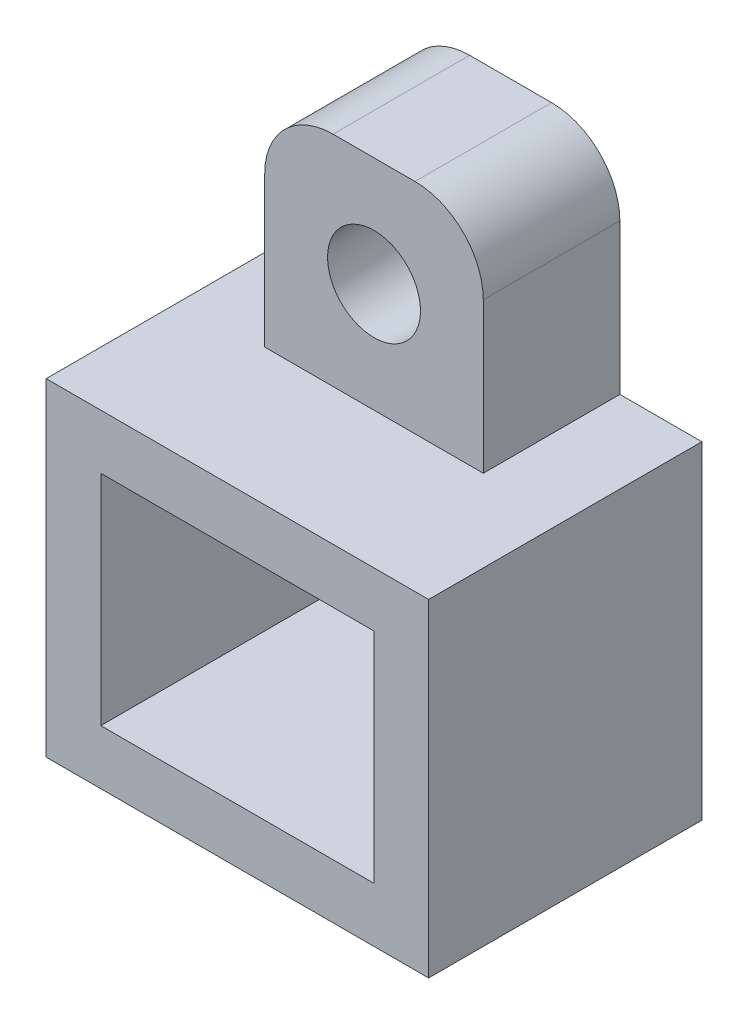
ISO-10303-21;
HEADER;
FILE_DESCRIPTION(('STEP AP214'),'2;1');
FILE_NAME('part.step','',(''),(''),'','','');
FILE_SCHEMA(('AUTOMOTIVE_DESIGN { 1 0 10303 214 1 1 1 1 }'));
ENDSEC;
DATA;
#1=APPLICATION_CONTEXT('core data for automotive mechanical design processes');
#2=APPLICATION_PROTOCOL_DEFINITION('international standard','automotive_design',2000,#1);
#3=PRODUCT_CONTEXT('',#1,'mechanical');
#4=PRODUCT('Part','Part','',(#3));
#5=PRODUCT_RELATED_PRODUCT_CATEGORY('part','',(#4));
#6=PRODUCT_DEFINITION_FORMATION('','',#4);
#7=PRODUCT_DEFINITION_CONTEXT('part definition',#1,'design');
#8=PRODUCT_DEFINITION('design','',#6,#7);
#9=PRODUCT_DEFINITION_SHAPE('','',#8);
#10=(LENGTH_UNIT() NAMED_UNIT(*) SI_UNIT(.MILLI.,.METRE.));
#11=(NAMED_UNIT(*) PLANE_ANGLE_UNIT() SI_UNIT($,.RADIAN.));
#12=(NAMED_UNIT(*) SI_UNIT($,.STERADIAN.) SOLID_ANGLE_UNIT());
#13=UNCERTAINTY_MEASURE_WITH_UNIT(LENGTH_MEASURE(1.E-05),#10,'distance_accuracy_value','');
#14=(GEOMETRIC_REPRESENTATION_CONTEXT(3) GLOBAL_UNCERTAINTY_ASSIGNED_CONTEXT((#13)) GLOBAL_UNIT_ASSIGNED_CONTEXT((#10,
#11,#12)) REPRESENTATION_CONTEXT('',''));
#15=CARTESIAN_POINT('',(0.,0.,0.));
#16=DIRECTION('',(0.,0.,1.));
#17=DIRECTION('',(1.,0.,0.));
#18=AXIS2_PLACEMENT_3D('',#15,#16,#17);
#19=CARTESIAN_POINT('',(0.,0.,0.));
#20=DIRECTION('',(0.,0.,1.));
#21=DIRECTION('',(1.,0.,0.));
#22=AXIS2_PLACEMENT_3D('',#19,#20,#21);
#23=PLANE('',#22);
#24=DIRECTION('',(0.,1.,0.));
#25=VECTOR('',#24,1.);
#26=CARTESIAN_POINT('',(5.00000000000001,4.00000000000001,0.));
#27=LINE('',#26,#25);
#28=CARTESIAN_POINT('',(5.,-3.99999999999999,0.));
#29=VERTEX_POINT('',#28);
#30=CARTESIAN_POINT('',(5.00000000000001,4.00000000000001,0.));
#31=VERTEX_POINT('',#30);
#32=EDGE_CURVE('E151',#29,#31,#27,.T.);
#33=ORIENTED_EDGE('',*,*,#32,.T.);
#34=DIRECTION('',(-1.,0.,0.));
#35=VECTOR('',#34,1.);
#36=CARTESIAN_POINT('',(-5.,4.00000000000001,0.));
#37=LINE('',#36,#35);
#38=CARTESIAN_POINT('',(-5.,4.00000000000001,0.));
#39=VERTEX_POINT('',#38);
#40=EDGE_CURVE('E391',#31,#39,#37,.T.);
#41=ORIENTED_EDGE('',*,*,#40,.T.);
#42=DIRECTION('',(0.,-1.,0.));
#43=VECTOR('',#42,1.);
#44=CARTESIAN_POINT('',(-5.,4.00000000000001,0.));
#45=LINE('',#44,#43);
#46=CARTESIAN_POINT('',(-5.,-3.99999999999999,0.));
#47=VERTEX_POINT('',#46);
#48=EDGE_CURVE('E394',#39,#47,#45,.T.);
#49=ORIENTED_EDGE('',*,*,#48,.T.);
#50=DIRECTION('',(1.,0.,0.));
#51=VECTOR('',#50,1.);
#52=CARTESIAN_POINT('',(-5.,-3.99999999999999,0.));
#53=LINE('',#52,#51);
#54=EDGE_CURVE('E386',#47,#29,#53,.T.);
#55=ORIENTED_EDGE('',*,*,#54,.T.);
#56=EDGE_LOOP('',(#33,#41,#49,#55));
#57=FACE_BOUND('',#56,.T.);
#58=DIRECTION('',(-1.,0.,0.));
#59=VECTOR('',#58,1.);
#60=CARTESIAN_POINT('',(-4.,14.,0.));
#61=LINE('',#60,#59);
#62=CARTESIAN_POINT('',(1.5,14.,0.));
#63=VERTEX_POINT('',#62);
#64=CARTESIAN_POINT('',(-1.5,14.,0.));
#65=VERTEX_POINT('',#64);
#66=EDGE_CURVE('E142',#63,#65,#61,.T.);
#67=ORIENTED_EDGE('',*,*,#66,.F.);
#68=CARTESIAN_POINT('',(1.5,11.5,0.));
#69=DIRECTION('',(0.,0.,1.));
#70=DIRECTION('',(1.,0.,0.));
#71=AXIS2_PLACEMENT_3D('',#68,#69,#70);
#72=CIRCLE('',#71,2.5);
#73=CARTESIAN_POINT('',(4.,11.5,0.));
#74=VERTEX_POINT('',#73);
#75=EDGE_CURVE('E194',#63,#74,#72,.F.);
#76=ORIENTED_EDGE('',*,*,#75,.T.);
#77=DIRECTION('',(0.,1.,0.));
#78=VECTOR('',#77,1.);
#79=CARTESIAN_POINT('',(4.,6.00000000000001,0.));
#80=LINE('',#79,#78);
#81=CARTESIAN_POINT('',(4.,6.00000000000001,0.));
#82=VERTEX_POINT('',#81);
#83=EDGE_CURVE('E166',#82,#74,#80,.T.);
#84=ORIENTED_EDGE('',*,*,#83,.F.);
#85=DIRECTION('',(-1.,0.,0.));
#86=VECTOR('',#85,1.);
#87=CARTESIAN_POINT('',(-7.00000000000001,6.00000000000001,0.));
#88=LINE('',#87,#86);
#89=CARTESIAN_POINT('',(7.00000000000001,6.00000000000001,0.));
#90=VERTEX_POINT('',#89);
#91=EDGE_CURVE('E427',#90,#82,#88,.T.);
#92=ORIENTED_EDGE('',*,*,#91,.F.);
#93=DIRECTION('',(0.,1.,0.));
#94=VECTOR('',#93,1.);
#95=CARTESIAN_POINT('',(7.00000000000001,6.00000000000001,0.));
#96=LINE('',#95,#94);
#97=CARTESIAN_POINT('',(7.00000000000001,-6.00000000000001,0.));
#98=VERTEX_POINT('',#97);
#99=EDGE_CURVE('E408',#98,#90,#96,.T.);
#100=ORIENTED_EDGE('',*,*,#99,.F.);
#101=DIRECTION('',(1.,0.,0.));
#102=VECTOR('',#101,1.);
#103=CARTESIAN_POINT('',(-7.00000000000001,-6.00000000000001,0.));
#104=LINE('',#103,#102);
#105=CARTESIAN_POINT('',(-7.00000000000001,-6.00000000000001,0.));
#106=VERTEX_POINT('',#105);
#107=EDGE_CURVE('E411',#106,#98,#104,.T.);
#108=ORIENTED_EDGE('',*,*,#107,.F.);
#109=DIRECTION('',(0.,-1.,0.));
#110=VECTOR('',#109,1.);
#111=CARTESIAN_POINT('',(-7.00000000000001,6.00000000000001,0.));
#112=LINE('',#111,#110);
#113=CARTESIAN_POINT('',(-7.00000000000001,6.00000000000001,0.));
#114=VERTEX_POINT('',#113);
#115=EDGE_CURVE('E423',#114,#106,#112,.T.);
#116=ORIENTED_EDGE('',*,*,#115,.F.);
#117=CARTESIAN_POINT('',(-4.,6.00000000000001,0.));
#118=VERTEX_POINT('',#117);
#119=EDGE_CURVE('E420',#118,#114,#88,.T.);
#120=ORIENTED_EDGE('',*,*,#119,.F.);
#121=DIRECTION('',(0.,-1.,0.));
#122=VECTOR('',#121,1.);
#123=CARTESIAN_POINT('',(-4.,6.00000000000001,0.));
#124=LINE('',#123,#122);
#125=CARTESIAN_POINT('',(-4.,11.5,0.));
#126=VERTEX_POINT('',#125);
#127=EDGE_CURVE('E148',#126,#118,#124,.T.);
#128=ORIENTED_EDGE('',*,*,#127,.F.);
#129=CARTESIAN_POINT('',(-1.5,11.5,0.));
#130=DIRECTION('',(0.,0.,1.));
#131=DIRECTION('',(1.,0.,0.));
#132=AXIS2_PLACEMENT_3D('',#129,#130,#131);
#133=CIRCLE('',#132,2.5);
#134=EDGE_CURVE('E191',#126,#65,#133,.F.);
#135=ORIENTED_EDGE('',*,*,#134,.T.);
#136=EDGE_LOOP('',(#67,#76,#84,#92,#100,#108,#116,#120,#128,#135));
#137=FACE_BOUND('',#136,.T.);
#138=CARTESIAN_POINT('',(0.,10.,0.));
#139=DIRECTION('',(0.,0.,1.));
#140=DIRECTION('',(1.,0.,0.));
#141=AXIS2_PLACEMENT_3D('',#138,#139,#140);
#142=CIRCLE('',#141,1.7);
#143=CARTESIAN_POINT('',(1.7,10.,0.));
#144=VERTEX_POINT('',#143);
#145=EDGE_CURVE('E184',#144,#144,#142,.T.);
#146=ORIENTED_EDGE('',*,*,#145,.T.);
#147=EDGE_LOOP('',(#146));
#148=FACE_BOUND('',#147,.T.);
#149=ADVANCED_FACE('F33',(#57,#137,#148),#23,.F.);
#150=CARTESIAN_POINT('',(0.,0.,5.));
#151=DIRECTION('',(0.,0.,-1.));
#152=DIRECTION('',(-1.,0.,0.));
#153=AXIS2_PLACEMENT_3D('',#150,#151,#152);
#154=PLANE('',#153);
#155=DIRECTION('',(0.,1.,0.));
#156=VECTOR('',#155,1.);
#157=CARTESIAN_POINT('',(4.,6.00000000000001,5.));
#158=LINE('',#157,#156);
#159=CARTESIAN_POINT('',(4.,6.00000000000001,5.));
#160=VERTEX_POINT('',#159);
#161=CARTESIAN_POINT('',(4.,11.5,5.));
#162=VERTEX_POINT('',#161);
#163=EDGE_CURVE('E157',#160,#162,#158,.T.);
#164=ORIENTED_EDGE('',*,*,#163,.T.);
#165=CARTESIAN_POINT('',(1.5,11.5,5.));
#166=DIRECTION('',(0.,0.,-1.));
#167=DIRECTION('',(-1.,0.,0.));
#168=AXIS2_PLACEMENT_3D('',#165,#166,#167);
#169=CIRCLE('',#168,2.5);
#170=CARTESIAN_POINT('',(1.5,14.,5.));
#171=VERTEX_POINT('',#170);
#172=EDGE_CURVE('E41',#162,#171,#169,.F.);
#173=ORIENTED_EDGE('',*,*,#172,.T.);
#174=DIRECTION('',(-1.,0.,0.));
#175=VECTOR('',#174,1.);
#176=CARTESIAN_POINT('',(-4.,14.,5.));
#177=LINE('',#176,#175);
#178=CARTESIAN_POINT('',(-1.5,14.,5.));
#179=VERTEX_POINT('',#178);
#180=EDGE_CURVE('E159',#171,#179,#177,.T.);
#181=ORIENTED_EDGE('',*,*,#180,.T.);
#182=CARTESIAN_POINT('',(-1.5,11.5,5.));
#183=DIRECTION('',(0.,0.,-1.));
#184=DIRECTION('',(-1.,0.,0.));
#185=AXIS2_PLACEMENT_3D('',#182,#183,#184);
#186=CIRCLE('',#185,2.5);
#187=CARTESIAN_POINT('',(-4.,11.5,5.));
#188=VERTEX_POINT('',#187);
#189=EDGE_CURVE('E48',#179,#188,#186,.F.);
#190=ORIENTED_EDGE('',*,*,#189,.T.);
#191=DIRECTION('',(0.,-1.,0.));
#192=VECTOR('',#191,1.);
#193=CARTESIAN_POINT('',(-4.,6.00000000000001,5.));
#194=LINE('',#193,#192);
#195=CARTESIAN_POINT('',(-4.,6.00000000000001,5.));
#196=VERTEX_POINT('',#195);
#197=EDGE_CURVE('E134',#188,#196,#194,.T.);
#198=ORIENTED_EDGE('',*,*,#197,.T.);
#199=DIRECTION('',(1.,0.,0.));
#200=VECTOR('',#199,1.);
#201=CARTESIAN_POINT('',(-4.,6.00000000000001,5.));
#202=LINE('',#201,#200);
#203=EDGE_CURVE('E139',#196,#160,#202,.T.);
#204=ORIENTED_EDGE('',*,*,#203,.T.);
#205=EDGE_LOOP('',(#164,#173,#181,#190,#198,#204));
#206=FACE_BOUND('',#205,.T.);
#207=CARTESIAN_POINT('',(0.,10.,5.));
#208=DIRECTION('',(0.,0.,-1.));
#209=DIRECTION('',(-1.,0.,0.));
#210=AXIS2_PLACEMENT_3D('',#207,#208,#209);
#211=CIRCLE('',#210,1.7);
#212=CARTESIAN_POINT('',(-1.7,10.,5.));
#213=VERTEX_POINT('',#212);
#214=EDGE_CURVE('E181',#213,#213,#211,.F.);
#215=ORIENTED_EDGE('',*,*,#214,.F.);
#216=EDGE_LOOP('',(#215));
#217=FACE_BOUND('',#216,.T.);
#218=ADVANCED_FACE('F136',(#206,#217),#154,.F.);
#219=CARTESIAN_POINT('',(-7.00000000000001,6.00000000000001,10.));
#220=DIRECTION('',(0.,-1.,0.));
#221=DIRECTION('',(0.,0.,-1.));
#222=AXIS2_PLACEMENT_3D('',#219,#220,#221);
#223=PLANE('',#222);
#224=DIRECTION('',(0.,0.,-1.));
#225=VECTOR('',#224,1.);
#226=CARTESIAN_POINT('',(4.,6.00000000000001,5.));
#227=LINE('',#226,#225);
#228=EDGE_CURVE('E152',#160,#82,#227,.T.);
#229=ORIENTED_EDGE('',*,*,#228,.F.);
#230=ORIENTED_EDGE('',*,*,#203,.F.);
#231=DIRECTION('',(0.,0.,-1.));
#232=VECTOR('',#231,1.);
#233=CARTESIAN_POINT('',(-4.,6.00000000000001,5.));
#234=LINE('',#233,#232);
#235=EDGE_CURVE('E145',#196,#118,#234,.T.);
#236=ORIENTED_EDGE('',*,*,#235,.T.);
#237=ORIENTED_EDGE('',*,*,#119,.T.);
#238=DIRECTION('',(0.,0.,-1.));
#239=VECTOR('',#238,1.);
#240=CARTESIAN_POINT('',(-7.00000000000001,6.00000000000001,10.));
#241=LINE('',#240,#239);
#242=CARTESIAN_POINT('',(-7.00000000000001,6.00000000000001,10.));
#243=VERTEX_POINT('',#242);
#244=EDGE_CURVE('E431',#243,#114,#241,.T.);
#245=ORIENTED_EDGE('',*,*,#244,.F.);
#246=DIRECTION('',(-1.,0.,0.));
#247=VECTOR('',#246,1.);
#248=CARTESIAN_POINT('',(-7.00000000000001,6.00000000000001,10.));
#249=LINE('',#248,#247);
#250=CARTESIAN_POINT('',(7.00000000000001,6.00000000000001,10.));
#251=VERTEX_POINT('',#250);
#252=EDGE_CURVE('E410',#251,#243,#249,.T.);
#253=ORIENTED_EDGE('',*,*,#252,.F.);
#254=DIRECTION('',(0.,0.,-1.));
#255=VECTOR('',#254,1.);
#256=CARTESIAN_POINT('',(7.00000000000001,6.00000000000001,10.));
#257=LINE('',#256,#255);
#258=EDGE_CURVE('E188',#251,#90,#257,.T.);
#259=ORIENTED_EDGE('',*,*,#258,.T.);
#260=ORIENTED_EDGE('',*,*,#91,.T.);
#261=EDGE_LOOP('',(#229,#230,#236,#237,#245,#253,#259,#260));
#262=FACE_BOUND('',#261,.T.);
#263=ADVANCED_FACE('F155',(#262),#223,.F.);
#264=CARTESIAN_POINT('',(0.,0.,10.));
#265=DIRECTION('',(0.,0.,1.));
#266=DIRECTION('',(1.,0.,0.));
#267=AXIS2_PLACEMENT_3D('',#264,#265,#266);
#268=PLANE('',#267);
#269=DIRECTION('',(0.,1.,0.));
#270=VECTOR('',#269,1.);
#271=CARTESIAN_POINT('',(7.00000000000001,6.00000000000001,10.));
#272=LINE('',#271,#270);
#273=CARTESIAN_POINT('',(7.00000000000001,-6.00000000000001,10.));
#274=VERTEX_POINT('',#273);
#275=EDGE_CURVE('E373',#274,#251,#272,.T.);
#276=ORIENTED_EDGE('',*,*,#275,.T.);
#277=ORIENTED_EDGE('',*,*,#252,.T.);
#278=DIRECTION('',(0.,-1.,0.));
#279=VECTOR('',#278,1.);
#280=CARTESIAN_POINT('',(-7.00000000000001,6.00000000000001,10.));
#281=LINE('',#280,#279);
#282=CARTESIAN_POINT('',(-7.00000000000001,-6.00000000000001,10.));
#283=VERTEX_POINT('',#282);
#284=EDGE_CURVE('E413',#243,#283,#281,.T.);
#285=ORIENTED_EDGE('',*,*,#284,.T.);
#286=DIRECTION('',(1.,0.,0.));
#287=VECTOR('',#286,1.);
#288=CARTESIAN_POINT('',(-7.00000000000001,-6.00000000000001,10.));
#289=LINE('',#288,#287);
#290=EDGE_CURVE('E415',#283,#274,#289,.T.);
#291=ORIENTED_EDGE('',*,*,#290,.T.);
#292=EDGE_LOOP('',(#276,#277,#285,#291));
#293=FACE_BOUND('',#292,.T.);
#294=DIRECTION('',(-1.,0.,0.));
#295=VECTOR('',#294,1.);
#296=CARTESIAN_POINT('',(-5.,4.00000000000001,10.));
#297=LINE('',#296,#295);
#298=CARTESIAN_POINT('',(5.00000000000001,4.00000000000001,10.));
#299=VERTEX_POINT('',#298);
#300=CARTESIAN_POINT('',(-5.,4.00000000000001,10.));
#301=VERTEX_POINT('',#300);
#302=EDGE_CURVE('E378',#299,#301,#297,.T.);
#303=ORIENTED_EDGE('',*,*,#302,.F.);
#304=DIRECTION('',(0.,1.,0.));
#305=VECTOR('',#304,1.);
#306=CARTESIAN_POINT('',(5.00000000000001,4.00000000000001,10.));
#307=LINE('',#306,#305);
#308=CARTESIAN_POINT('',(5.,-3.99999999999999,10.));
#309=VERTEX_POINT('',#308);
#310=EDGE_CURVE('E169',#309,#299,#307,.T.);
#311=ORIENTED_EDGE('',*,*,#310,.F.);
#312=DIRECTION('',(1.,0.,0.));
#313=VECTOR('',#312,1.);
#314=CARTESIAN_POINT('',(-5.,-3.99999999999999,10.));
#315=LINE('',#314,#313);
#316=CARTESIAN_POINT('',(-5.,-3.99999999999999,10.));
#317=VERTEX_POINT('',#316);
#318=EDGE_CURVE('E384',#317,#309,#315,.T.);
#319=ORIENTED_EDGE('',*,*,#318,.F.);
#320=DIRECTION('',(0.,-1.,0.));
#321=VECTOR('',#320,1.);
#322=CARTESIAN_POINT('',(-5.,4.00000000000001,10.));
#323=LINE('',#322,#321);
#324=EDGE_CURVE('E381',#301,#317,#323,.T.);
#325=ORIENTED_EDGE('',*,*,#324,.F.);
#326=EDGE_LOOP('',(#303,#311,#319,#325));
#327=FACE_BOUND('',#326,.T.);
#328=ADVANCED_FACE('F230',(#293,#327),#268,.T.);
#329=CARTESIAN_POINT('',(7.00000000000001,6.00000000000001,10.));
#330=DIRECTION('',(-1.,0.,0.));
#331=DIRECTION('',(0.,0.,1.));
#332=AXIS2_PLACEMENT_3D('',#329,#330,#331);
#333=PLANE('',#332);
#334=ORIENTED_EDGE('',*,*,#99,.T.);
#335=ORIENTED_EDGE('',*,*,#258,.F.);
#336=ORIENTED_EDGE('',*,*,#275,.F.);
#337=DIRECTION('',(0.,0.,-1.));
#338=VECTOR('',#337,1.);
#339=CARTESIAN_POINT('',(7.00000000000001,-6.00000000000001,10.));
#340=LINE('',#339,#338);
#341=EDGE_CURVE('E417',#274,#98,#340,.T.);
#342=ORIENTED_EDGE('',*,*,#341,.T.);
#343=EDGE_LOOP('',(#334,#335,#336,#342));
#344=FACE_BOUND('',#343,.T.);
#345=ADVANCED_FACE('F240',(#344),#333,.F.);
#346=CARTESIAN_POINT('',(-7.00000000000001,6.00000000000001,10.));
#347=DIRECTION('',(1.,0.,0.));
#348=DIRECTION('',(0.,0.,-1.));
#349=AXIS2_PLACEMENT_3D('',#346,#347,#348);
#350=PLANE('',#349);
#351=ORIENTED_EDGE('',*,*,#115,.T.);
#352=DIRECTION('',(0.,0.,-1.));
#353=VECTOR('',#352,1.);
#354=CARTESIAN_POINT('',(-7.00000000000001,-6.00000000000001,10.));
#355=LINE('',#354,#353);
#356=EDGE_CURVE('E434',#283,#106,#355,.T.);
#357=ORIENTED_EDGE('',*,*,#356,.F.);
#358=ORIENTED_EDGE('',*,*,#284,.F.);
#359=ORIENTED_EDGE('',*,*,#244,.T.);
#360=EDGE_LOOP('',(#351,#357,#358,#359));
#361=FACE_BOUND('',#360,.T.);
#362=ADVANCED_FACE('F236',(#361),#350,.F.);
#363=CARTESIAN_POINT('',(-7.00000000000001,-6.00000000000001,10.));
#364=DIRECTION('',(0.,1.,0.));
#365=DIRECTION('',(0.,0.,1.));
#366=AXIS2_PLACEMENT_3D('',#363,#364,#365);
#367=PLANE('',#366);
#368=ORIENTED_EDGE('',*,*,#107,.T.);
#369=ORIENTED_EDGE('',*,*,#341,.F.);
#370=ORIENTED_EDGE('',*,*,#290,.F.);
#371=ORIENTED_EDGE('',*,*,#356,.T.);
#372=EDGE_LOOP('',(#368,#369,#370,#371));
#373=FACE_BOUND('',#372,.T.);
#374=ADVANCED_FACE('F232',(#373),#367,.F.);
#375=CARTESIAN_POINT('',(5.00000000000001,4.00000000000001,10.));
#376=DIRECTION('',(-1.,0.,0.));
#377=DIRECTION('',(0.,-1.,0.));
#378=AXIS2_PLACEMENT_3D('',#375,#376,#377);
#379=PLANE('',#378);
#380=ORIENTED_EDGE('',*,*,#32,.F.);
#381=DIRECTION('',(0.,0.,-1.));
#382=VECTOR('',#381,1.);
#383=CARTESIAN_POINT('',(5.,-3.99999999999999,10.));
#384=LINE('',#383,#382);
#385=EDGE_CURVE('E389',#309,#29,#384,.T.);
#386=ORIENTED_EDGE('',*,*,#385,.F.);
#387=ORIENTED_EDGE('',*,*,#310,.T.);
#388=DIRECTION('',(0.,0.,-1.));
#389=VECTOR('',#388,1.);
#390=CARTESIAN_POINT('',(5.00000000000001,4.00000000000001,10.));
#391=LINE('',#390,#389);
#392=EDGE_CURVE('E405',#299,#31,#391,.T.);
#393=ORIENTED_EDGE('',*,*,#392,.T.);
#394=EDGE_LOOP('',(#380,#386,#387,#393));
#395=FACE_BOUND('',#394,.T.);
#396=ADVANCED_FACE('F235',(#395),#379,.T.);
#397=CARTESIAN_POINT('',(-5.,4.00000000000001,10.));
#398=DIRECTION('',(0.,-1.,0.));
#399=DIRECTION('',(0.,0.,-1.));
#400=AXIS2_PLACEMENT_3D('',#397,#398,#399);
#401=PLANE('',#400);
#402=ORIENTED_EDGE('',*,*,#40,.F.);
#403=ORIENTED_EDGE('',*,*,#392,.F.);
#404=ORIENTED_EDGE('',*,*,#302,.T.);
#405=DIRECTION('',(0.,0.,-1.));
#406=VECTOR('',#405,1.);
#407=CARTESIAN_POINT('',(-5.,4.00000000000001,10.));
#408=LINE('',#407,#406);
#409=EDGE_CURVE('E403',#301,#39,#408,.T.);
#410=ORIENTED_EDGE('',*,*,#409,.T.);
#411=EDGE_LOOP('',(#402,#403,#404,#410));
#412=FACE_BOUND('',#411,.T.);
#413=ADVANCED_FACE('F315',(#412),#401,.T.);
#414=CARTESIAN_POINT('',(-5.,4.00000000000001,10.));
#415=DIRECTION('',(1.,0.,0.));
#416=DIRECTION('',(0.,1.,0.));
#417=AXIS2_PLACEMENT_3D('',#414,#415,#416);
#418=PLANE('',#417);
#419=ORIENTED_EDGE('',*,*,#48,.F.);
#420=ORIENTED_EDGE('',*,*,#409,.F.);
#421=ORIENTED_EDGE('',*,*,#324,.T.);
#422=DIRECTION('',(0.,0.,-1.));
#423=VECTOR('',#422,1.);
#424=CARTESIAN_POINT('',(-5.,-3.99999999999999,10.));
#425=LINE('',#424,#423);
#426=EDGE_CURVE('E401',#317,#47,#425,.T.);
#427=ORIENTED_EDGE('',*,*,#426,.T.);
#428=EDGE_LOOP('',(#419,#420,#421,#427));
#429=FACE_BOUND('',#428,.T.);
#430=ADVANCED_FACE('F307',(#429),#418,.T.);
#431=CARTESIAN_POINT('',(-5.,-3.99999999999999,10.));
#432=DIRECTION('',(0.,1.,0.));
#433=DIRECTION('',(0.,0.,1.));
#434=AXIS2_PLACEMENT_3D('',#431,#432,#433);
#435=PLANE('',#434);
#436=ORIENTED_EDGE('',*,*,#54,.F.);
#437=ORIENTED_EDGE('',*,*,#426,.F.);
#438=ORIENTED_EDGE('',*,*,#318,.T.);
#439=ORIENTED_EDGE('',*,*,#385,.T.);
#440=EDGE_LOOP('',(#436,#437,#438,#439));
#441=FACE_BOUND('',#440,.T.);
#442=ADVANCED_FACE('F218',(#441),#435,.T.);
#443=CARTESIAN_POINT('',(-4.,6.00000000000001,5.));
#444=DIRECTION('',(1.,0.,0.));
#445=DIRECTION('',(0.,0.,-1.));
#446=AXIS2_PLACEMENT_3D('',#443,#444,#445);
#447=PLANE('',#446);
#448=ORIENTED_EDGE('',*,*,#197,.F.);
#449=DIRECTION('',(0.,0.,-1.));
#450=VECTOR('',#449,1.);
#451=CARTESIAN_POINT('',(-4.,11.5,5.));
#452=LINE('',#451,#450);
#453=EDGE_CURVE('E11',#188,#126,#452,.T.);
#454=ORIENTED_EDGE('',*,*,#453,.T.);
#455=ORIENTED_EDGE('',*,*,#127,.T.);
#456=ORIENTED_EDGE('',*,*,#235,.F.);
#457=EDGE_LOOP('',(#448,#454,#455,#456));
#458=FACE_BOUND('',#457,.T.);
#459=ADVANCED_FACE('F146',(#458),#447,.F.);
#460=CARTESIAN_POINT('',(4.,6.00000000000001,5.));
#461=DIRECTION('',(-1.,0.,0.));
#462=DIRECTION('',(0.,0.,1.));
#463=AXIS2_PLACEMENT_3D('',#460,#461,#462);
#464=PLANE('',#463);
#465=ORIENTED_EDGE('',*,*,#83,.T.);
#466=DIRECTION('',(0.,0.,-1.));
#467=VECTOR('',#466,1.);
#468=CARTESIAN_POINT('',(4.,11.5,5.));
#469=LINE('',#468,#467);
#470=EDGE_CURVE('E56',#74,#162,#469,.F.);
#471=ORIENTED_EDGE('',*,*,#470,.T.);
#472=ORIENTED_EDGE('',*,*,#163,.F.);
#473=ORIENTED_EDGE('',*,*,#228,.T.);
#474=EDGE_LOOP('',(#465,#471,#472,#473));
#475=FACE_BOUND('',#474,.T.);
#476=ADVANCED_FACE('F209',(#475),#464,.F.);
#477=CARTESIAN_POINT('',(-4.,14.,5.));
#478=DIRECTION('',(0.,-1.,0.));
#479=DIRECTION('',(0.,0.,-1.));
#480=AXIS2_PLACEMENT_3D('',#477,#478,#479);
#481=PLANE('',#480);
#482=ORIENTED_EDGE('',*,*,#180,.F.);
#483=DIRECTION('',(0.,0.,-1.));
#484=VECTOR('',#483,1.);
#485=CARTESIAN_POINT('',(1.5,14.,5.));
#486=LINE('',#485,#484);
#487=EDGE_CURVE('E187',#171,#63,#486,.T.);
#488=ORIENTED_EDGE('',*,*,#487,.T.);
#489=ORIENTED_EDGE('',*,*,#66,.T.);
#490=DIRECTION('',(0.,0.,-1.));
#491=VECTOR('',#490,1.);
#492=CARTESIAN_POINT('',(-1.5,14.,5.));
#493=LINE('',#492,#491);
#494=EDGE_CURVE('E185',#65,#179,#493,.F.);
#495=ORIENTED_EDGE('',*,*,#494,.T.);
#496=EDGE_LOOP('',(#482,#488,#489,#495));
#497=FACE_BOUND('',#496,.T.);
#498=ADVANCED_FACE('F202',(#497),#481,.F.);
#499=CARTESIAN_POINT('',(0.,10.,10.));
#500=DIRECTION('',(0.,0.,-1.));
#501=DIRECTION('',(-1.,0.,0.));
#502=AXIS2_PLACEMENT_3D('',#499,#500,#501);
#503=CYLINDRICAL_SURFACE('',#502,1.7);
#504=ORIENTED_EDGE('',*,*,#145,.F.);
#505=EDGE_LOOP('',(#504));
#506=FACE_BOUND('',#505,.T.);
#507=ORIENTED_EDGE('',*,*,#214,.T.);
#508=EDGE_LOOP('',(#507));
#509=FACE_BOUND('',#508,.T.);
#510=ADVANCED_FACE('F216',(#506,#509),#503,.F.);
#511=CARTESIAN_POINT('',(1.5,11.5,5.));
#512=DIRECTION('',(0.,0.,-1.));
#513=DIRECTION('',(-1.,0.,0.));
#514=AXIS2_PLACEMENT_3D('',#511,#512,#513);
#515=CYLINDRICAL_SURFACE('',#514,2.5);
#516=ORIENTED_EDGE('',*,*,#172,.F.);
#517=ORIENTED_EDGE('',*,*,#470,.F.);
#518=ORIENTED_EDGE('',*,*,#75,.F.);
#519=ORIENTED_EDGE('',*,*,#487,.F.);
#520=EDGE_LOOP('',(#516,#517,#518,#519));
#521=FACE_BOUND('',#520,.T.);
#522=ADVANCED_FACE('F205',(#521),#515,.T.);
#523=CARTESIAN_POINT('',(-1.5,11.5,5.));
#524=DIRECTION('',(0.,0.,-1.));
#525=DIRECTION('',(-1.,0.,0.));
#526=AXIS2_PLACEMENT_3D('',#523,#524,#525);
#527=CYLINDRICAL_SURFACE('',#526,2.5);
#528=ORIENTED_EDGE('',*,*,#189,.F.);
#529=ORIENTED_EDGE('',*,*,#494,.F.);
#530=ORIENTED_EDGE('',*,*,#134,.F.);
#531=ORIENTED_EDGE('',*,*,#453,.F.);
#532=EDGE_LOOP('',(#528,#529,#530,#531));
#533=FACE_BOUND('',#532,.T.);
#534=ADVANCED_FACE('F35',(#533),#527,.T.);
#535=CLOSED_SHELL('',(#149,#218,#263,#328,#345,#362,#374,#396,#413,#430,#442,#459,#476,#498,
#510,#522,#534));
#536=MANIFOLD_SOLID_BREP('B2',#535);
#537=ADVANCED_BREP_SHAPE_REPRESENTATION('',(#18,#536),#14);
#538=SHAPE_DEFINITION_REPRESENTATION(#9,#537);
ENDSEC;
END-ISO-10303-21;
